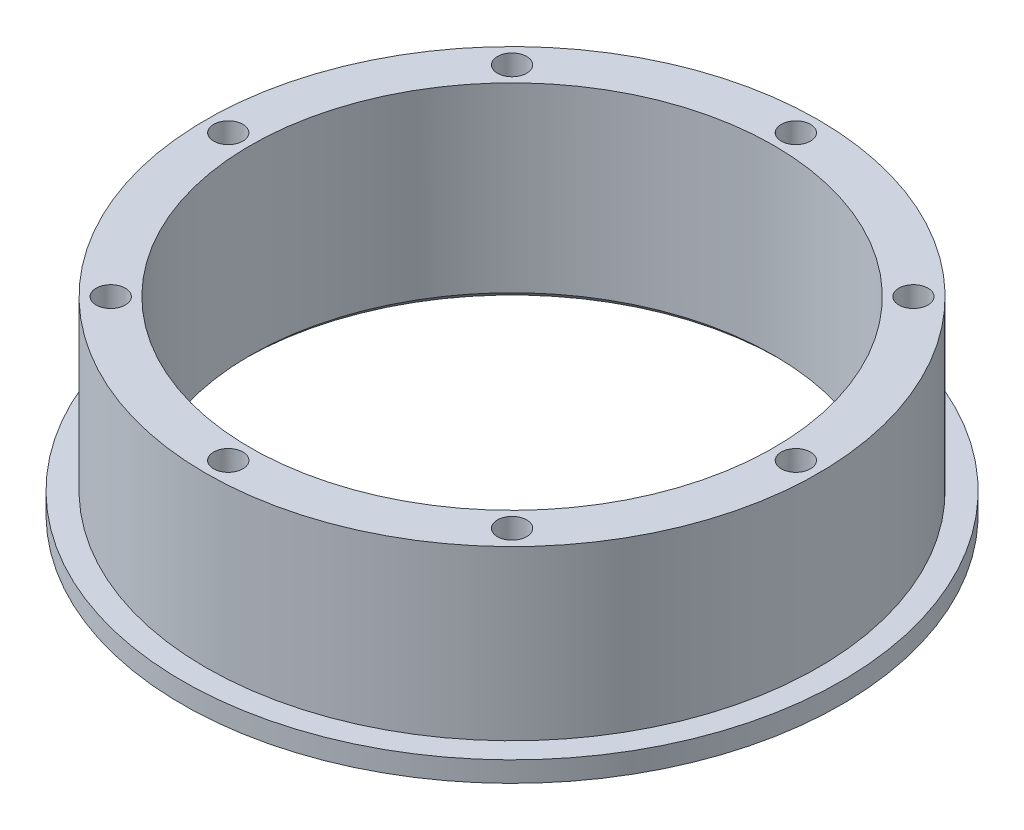
ISO-10303-21;
HEADER;
FILE_DESCRIPTION(('STEP AP214'),'2;1');
FILE_NAME('part.step','',(''),(''),'','','');
FILE_SCHEMA(('AUTOMOTIVE_DESIGN { 1 0 10303 214 1 1 1 1 }'));
ENDSEC;
DATA;
#1=APPLICATION_CONTEXT('core data for automotive mechanical design processes');
#2=APPLICATION_PROTOCOL_DEFINITION('international standard','automotive_design',2000,#1);
#3=PRODUCT_CONTEXT('',#1,'mechanical');
#4=PRODUCT('Part','Part','',(#3));
#5=PRODUCT_RELATED_PRODUCT_CATEGORY('part','',(#4));
#6=PRODUCT_DEFINITION_FORMATION('','',#4);
#7=PRODUCT_DEFINITION_CONTEXT('part definition',#1,'design');
#8=PRODUCT_DEFINITION('design','',#6,#7);
#9=PRODUCT_DEFINITION_SHAPE('','',#8);
#10=(LENGTH_UNIT() NAMED_UNIT(*) SI_UNIT(.MILLI.,.METRE.));
#11=(NAMED_UNIT(*) PLANE_ANGLE_UNIT() SI_UNIT($,.RADIAN.));
#12=(NAMED_UNIT(*) SI_UNIT($,.STERADIAN.) SOLID_ANGLE_UNIT());
#13=UNCERTAINTY_MEASURE_WITH_UNIT(LENGTH_MEASURE(1.E-05),#10,'distance_accuracy_value','');
#14=(GEOMETRIC_REPRESENTATION_CONTEXT(3) GLOBAL_UNCERTAINTY_ASSIGNED_CONTEXT((#13)) GLOBAL_UNIT_ASSIGNED_CONTEXT((#10,
#11,#12)) REPRESENTATION_CONTEXT('',''));
#15=CARTESIAN_POINT('',(0.,0.,0.));
#16=DIRECTION('',(0.,0.,1.));
#17=DIRECTION('',(1.,0.,0.));
#18=AXIS2_PLACEMENT_3D('',#15,#16,#17);
#19=CARTESIAN_POINT('',(0.,-102.238891196625,0.));
#20=DIRECTION('',(0.,-1.,0.));
#21=DIRECTION('',(0.,0.,-1.));
#22=AXIS2_PLACEMENT_3D('',#19,#20,#21);
#23=CYLINDRICAL_SURFACE('',#22,48.5);
#24=CARTESIAN_POINT('',(0.,-86.75,0.));
#25=DIRECTION('',(0.,-1.,0.));
#26=DIRECTION('',(0.,0.,-1.));
#27=AXIS2_PLACEMENT_3D('',#24,#25,#26);
#28=CIRCLE('',#27,48.5);
#29=CARTESIAN_POINT('',(0.,-86.75,-48.5));
#30=VERTEX_POINT('',#29);
#31=EDGE_CURVE('E47',#30,#30,#28,.T.);
#32=ORIENTED_EDGE('',*,*,#31,.F.);
#33=EDGE_LOOP('',(#32));
#34=FACE_BOUND('',#33,.T.);
#35=CARTESIAN_POINT('',(0.,-83.75,0.));
#36=DIRECTION('',(0.,-1.,0.));
#37=DIRECTION('',(0.,0.,-1.));
#38=AXIS2_PLACEMENT_3D('',#35,#36,#37);
#39=CIRCLE('',#38,48.5);
#40=CARTESIAN_POINT('',(0.,-83.75,-48.5));
#41=VERTEX_POINT('',#40);
#42=EDGE_CURVE('E52',#41,#41,#39,.T.);
#43=ORIENTED_EDGE('',*,*,#42,.T.);
#44=EDGE_LOOP('',(#43));
#45=FACE_BOUND('',#44,.T.);
#46=ADVANCED_FACE('F34',(#34,#45),#23,.T.);
#47=CARTESIAN_POINT('',(-48.5,-86.75,0.));
#48=DIRECTION('',(0.,1.,0.));
#49=DIRECTION('',(0.,0.,1.));
#50=AXIS2_PLACEMENT_3D('',#47,#48,#49);
#51=PLANE('',#50);
#52=CARTESIAN_POINT('',(0.,-86.75,0.));
#53=DIRECTION('',(0.,1.,0.));
#54=DIRECTION('',(0.,0.,1.));
#55=AXIS2_PLACEMENT_3D('',#52,#53,#54);
#56=CIRCLE('',#55,39.5272340808313);
#57=CARTESIAN_POINT('',(0.,-86.75,39.5272340808313));
#58=VERTEX_POINT('',#57);
#59=EDGE_CURVE('E11',#58,#58,#56,.T.);
#60=ORIENTED_EDGE('',*,*,#59,.T.);
#61=EDGE_LOOP('',(#60));
#62=FACE_BOUND('',#61,.T.);
#63=ORIENTED_EDGE('',*,*,#31,.T.);
#64=EDGE_LOOP('',(#63));
#65=FACE_BOUND('',#64,.T.);
#66=ADVANCED_FACE('F71',(#62,#65),#51,.F.);
#67=CARTESIAN_POINT('',(0.,-102.238891196625,0.));
#68=DIRECTION('',(0.,-1.,0.));
#69=DIRECTION('',(0.,0.,-1.));
#70=AXIS2_PLACEMENT_3D('',#67,#68,#69);
#71=CYLINDRICAL_SURFACE('',#70,38.5272340808313);
#72=CARTESIAN_POINT('',(0.,-85.75,0.));
#73=DIRECTION('',(0.,1.,0.));
#74=DIRECTION('',(0.,0.,1.));
#75=AXIS2_PLACEMENT_3D('',#72,#73,#74);
#76=CIRCLE('',#75,38.5272340808313);
#77=CARTESIAN_POINT('',(0.,-85.75,38.5272340808313));
#78=VERTEX_POINT('',#77);
#79=EDGE_CURVE('E42',#78,#78,#76,.F.);
#80=ORIENTED_EDGE('',*,*,#79,.T.);
#81=EDGE_LOOP('',(#80));
#82=FACE_BOUND('',#81,.T.);
#83=CARTESIAN_POINT('',(0.,-58.9999999999998,0.));
#84=DIRECTION('',(0.,-1.,0.));
#85=DIRECTION('',(0.,0.,-1.));
#86=AXIS2_PLACEMENT_3D('',#83,#84,#85);
#87=CIRCLE('',#86,38.5272340808313);
#88=CARTESIAN_POINT('',(0.,-58.9999999999998,-38.5272340808313));
#89=VERTEX_POINT('',#88);
#90=EDGE_CURVE('E56',#89,#89,#87,.T.);
#91=ORIENTED_EDGE('',*,*,#90,.F.);
#92=EDGE_LOOP('',(#91));
#93=FACE_BOUND('',#92,.T.);
#94=ADVANCED_FACE('F78',(#82,#93),#71,.F.);
#95=CARTESIAN_POINT('',(-45.,-59.,0.));
#96=DIRECTION('',(0.,-1.,0.));
#97=DIRECTION('',(0.,0.,-1.));
#98=AXIS2_PLACEMENT_3D('',#95,#96,#97);
#99=PLANE('',#98);
#100=CARTESIAN_POINT('',(-41.7636170404156,-59.,0.));
#101=DIRECTION('',(0.,1.,0.));
#102=DIRECTION('',(1.,0.,0.));
#103=AXIS2_PLACEMENT_3D('',#100,#101,#102);
#104=CIRCLE('',#103,2.15);
#105=CARTESIAN_POINT('',(-39.6136170404156,-59.,0.));
#106=VERTEX_POINT('',#105);
#107=EDGE_CURVE('E194',#106,#106,#104,.T.);
#108=ORIENTED_EDGE('',*,*,#107,.F.);
#109=EDGE_LOOP('',(#108));
#110=FACE_BOUND('',#109,.T.);
#111=CARTESIAN_POINT('',(-29.5313368161559,-59.,29.531336816156));
#112=DIRECTION('',(0.,1.,0.));
#113=DIRECTION('',(0.707106781186544,0.,-0.707106781186551));
#114=AXIS2_PLACEMENT_3D('',#111,#112,#113);
#115=CIRCLE('',#114,2.15);
#116=CARTESIAN_POINT('',(-28.0110572366049,-59.,28.0110572366049));
#117=VERTEX_POINT('',#116);
#118=EDGE_CURVE('E202',#117,#117,#115,.T.);
#119=ORIENTED_EDGE('',*,*,#118,.F.);
#120=EDGE_LOOP('',(#119));
#121=FACE_BOUND('',#120,.T.);
#122=CARTESIAN_POINT('',(-1.79804786889257E-13,-59.,41.7636170404156));
#123=DIRECTION('',(0.,1.,0.));
#124=DIRECTION('',(0.,0.,-1.));
#125=AXIS2_PLACEMENT_3D('',#122,#123,#124);
#126=CIRCLE('',#125,2.15);
#127=CARTESIAN_POINT('',(-1.79804786889257E-13,-59.,39.6136170404156));
#128=VERTEX_POINT('',#127);
#129=EDGE_CURVE('E208',#128,#128,#126,.T.);
#130=ORIENTED_EDGE('',*,*,#129,.F.);
#131=EDGE_LOOP('',(#130));
#132=FACE_BOUND('',#131,.T.);
#133=CARTESIAN_POINT('',(29.5313368161561,-59.,29.5313368161558));
#134=DIRECTION('',(0.,1.,0.));
#135=DIRECTION('',(-0.707106781186554,0.,-0.707106781186541));
#136=AXIS2_PLACEMENT_3D('',#133,#134,#135);
#137=CIRCLE('',#136,2.15);
#138=CARTESIAN_POINT('',(28.011057236605,-59.,28.0110572366048));
#139=VERTEX_POINT('',#138);
#140=EDGE_CURVE('E179',#139,#139,#137,.T.);
#141=ORIENTED_EDGE('',*,*,#140,.F.);
#142=EDGE_LOOP('',(#141));
#143=FACE_BOUND('',#142,.T.);
#144=CARTESIAN_POINT('',(41.7636170404156,-59.,-2.5764588172835E-13));
#145=DIRECTION('',(0.,1.,0.));
#146=DIRECTION('',(-1.,0.,0.));
#147=AXIS2_PLACEMENT_3D('',#144,#145,#146);
#148=CIRCLE('',#147,2.15);
#149=CARTESIAN_POINT('',(39.6136170404156,-59.,-2.35125827092811E-13));
#150=VERTEX_POINT('',#149);
#151=EDGE_CURVE('E180',#150,#150,#148,.T.);
#152=ORIENTED_EDGE('',*,*,#151,.F.);
#153=EDGE_LOOP('',(#152));
#154=FACE_BOUND('',#153,.T.);
#155=CARTESIAN_POINT('',(29.5313368161557,-59.,-29.5313368161562));
#156=DIRECTION('',(0.,1.,0.));
#157=DIRECTION('',(-0.707106781186539,0.,0.707106781186556));
#158=AXIS2_PLACEMENT_3D('',#155,#156,#157);
#159=CIRCLE('',#158,2.15);
#160=CARTESIAN_POINT('',(28.0110572366047,-59.,-28.0110572366051));
#161=VERTEX_POINT('',#160);
#162=EDGE_CURVE('E189',#161,#161,#159,.T.);
#163=ORIENTED_EDGE('',*,*,#162,.F.);
#164=EDGE_LOOP('',(#163));
#165=FACE_BOUND('',#164,.T.);
#166=CARTESIAN_POINT('',(-29.5313368161559,-59.,-29.531336816156));
#167=DIRECTION('',(0.,1.,0.));
#168=DIRECTION('',(0.707106781186549,0.,0.707106781186546));
#169=AXIS2_PLACEMENT_3D('',#166,#167,#168);
#170=CIRCLE('',#169,2.15);
#171=CARTESIAN_POINT('',(-28.0110572366048,-59.,-28.011057236605));
#172=VERTEX_POINT('',#171);
#173=EDGE_CURVE('E201',#172,#172,#170,.T.);
#174=ORIENTED_EDGE('',*,*,#173,.F.);
#175=EDGE_LOOP('',(#174));
#176=FACE_BOUND('',#175,.T.);
#177=CARTESIAN_POINT('',(1.79804786889257E-13,-59.,-41.7636170404156));
#178=DIRECTION('',(0.,1.,0.));
#179=DIRECTION('',(0.,0.,1.));
#180=AXIS2_PLACEMENT_3D('',#177,#178,#179);
#181=CIRCLE('',#180,2.15);
#182=CARTESIAN_POINT('',(1.79804786889257E-13,-59.,-39.6136170404156));
#183=VERTEX_POINT('',#182);
#184=EDGE_CURVE('E63',#183,#183,#181,.T.);
#185=ORIENTED_EDGE('',*,*,#184,.F.);
#186=EDGE_LOOP('',(#185));
#187=FACE_BOUND('',#186,.T.);
#188=CARTESIAN_POINT('',(0.,-59.,0.));
#189=DIRECTION('',(0.,-1.,0.));
#190=DIRECTION('',(0.,0.,-1.));
#191=AXIS2_PLACEMENT_3D('',#188,#189,#190);
#192=CIRCLE('',#191,45.0625);
#193=CARTESIAN_POINT('',(0.,-59.,-45.0625));
#194=VERTEX_POINT('',#193);
#195=EDGE_CURVE('E38',#194,#194,#192,.T.);
#196=ORIENTED_EDGE('',*,*,#195,.F.);
#197=EDGE_LOOP('',(#196));
#198=FACE_BOUND('',#197,.T.);
#199=ORIENTED_EDGE('',*,*,#90,.T.);
#200=EDGE_LOOP('',(#199));
#201=FACE_BOUND('',#200,.T.);
#202=ADVANCED_FACE('F99',(#110,#121,#132,#143,#154,#165,#176,#187,#198,#201),#99,.F.);
#203=CARTESIAN_POINT('',(0.,-102.238891196625,0.));
#204=DIRECTION('',(0.,-1.,0.));
#205=DIRECTION('',(0.,0.,-1.));
#206=AXIS2_PLACEMENT_3D('',#203,#204,#205);
#207=CYLINDRICAL_SURFACE('',#206,45.0625);
#208=CARTESIAN_POINT('',(0.,-83.75,0.));
#209=DIRECTION('',(0.,-1.,0.));
#210=DIRECTION('',(0.,0.,-1.));
#211=AXIS2_PLACEMENT_3D('',#208,#209,#210);
#212=CIRCLE('',#211,45.0625);
#213=CARTESIAN_POINT('',(0.,-83.75,-45.0625));
#214=VERTEX_POINT('',#213);
#215=EDGE_CURVE('E50',#214,#214,#212,.T.);
#216=ORIENTED_EDGE('',*,*,#215,.F.);
#217=EDGE_LOOP('',(#216));
#218=FACE_BOUND('',#217,.T.);
#219=ORIENTED_EDGE('',*,*,#195,.T.);
#220=EDGE_LOOP('',(#219));
#221=FACE_BOUND('',#220,.T.);
#222=ADVANCED_FACE('F36',(#218,#221),#207,.T.);
#223=CARTESIAN_POINT('',(-48.5,-83.75,0.));
#224=DIRECTION('',(0.,-1.,0.));
#225=DIRECTION('',(0.,0.,-1.));
#226=AXIS2_PLACEMENT_3D('',#223,#224,#225);
#227=PLANE('',#226);
#228=ORIENTED_EDGE('',*,*,#42,.F.);
#229=EDGE_LOOP('',(#228));
#230=FACE_BOUND('',#229,.T.);
#231=ORIENTED_EDGE('',*,*,#215,.T.);
#232=EDGE_LOOP('',(#231));
#233=FACE_BOUND('',#232,.T.);
#234=ADVANCED_FACE('F108',(#230,#233),#227,.F.);
#235=CARTESIAN_POINT('',(1.79804786889257E-13,-67.,-41.7636170404156));
#236=DIRECTION('',(0.,1.,0.));
#237=DIRECTION('',(0.,0.,1.));
#238=AXIS2_PLACEMENT_3D('',#235,#236,#237);
#239=CYLINDRICAL_SURFACE('',#238,2.15);
#240=CARTESIAN_POINT('',(1.79804786889257E-13,-67.,-41.7636170404156));
#241=DIRECTION('',(0.,1.,0.));
#242=DIRECTION('',(0.,0.,1.));
#243=AXIS2_PLACEMENT_3D('',#240,#241,#242);
#244=CIRCLE('',#243,2.15);
#245=CARTESIAN_POINT('',(1.79804786889257E-13,-67.,-39.6136170404156));
#246=VERTEX_POINT('',#245);
#247=EDGE_CURVE('E58',#246,#246,#244,.T.);
#248=ORIENTED_EDGE('',*,*,#247,.F.);
#249=EDGE_LOOP('',(#248));
#250=FACE_BOUND('',#249,.T.);
#251=ORIENTED_EDGE('',*,*,#184,.T.);
#252=EDGE_LOOP('',(#251));
#253=FACE_BOUND('',#252,.T.);
#254=ADVANCED_FACE('F115',(#250,#253),#239,.F.);
#255=CARTESIAN_POINT('',(1.79804786889257E-13,-67.,-41.7636170404156));
#256=DIRECTION('',(0.,1.,0.));
#257=DIRECTION('',(0.,0.,1.));
#258=AXIS2_PLACEMENT_3D('',#255,#256,#257);
#259=PLANE('',#258);
#260=ORIENTED_EDGE('',*,*,#247,.T.);
#261=EDGE_LOOP('',(#260));
#262=FACE_BOUND('',#261,.T.);
#263=ADVANCED_FACE('F119',(#262),#259,.T.);
#264=CARTESIAN_POINT('',(-29.5313368161559,-67.,-29.531336816156));
#265=DIRECTION('',(0.,1.,0.));
#266=DIRECTION('',(0.707106781186549,0.,0.707106781186546));
#267=AXIS2_PLACEMENT_3D('',#264,#265,#266);
#268=CYLINDRICAL_SURFACE('',#267,2.15);
#269=CARTESIAN_POINT('',(-29.5313368161559,-67.,-29.531336816156));
#270=DIRECTION('',(0.,1.,0.));
#271=DIRECTION('',(0.707106781186549,0.,0.707106781186546));
#272=AXIS2_PLACEMENT_3D('',#269,#270,#271);
#273=CIRCLE('',#272,2.15);
#274=CARTESIAN_POINT('',(-28.0110572366048,-67.,-28.011057236605));
#275=VERTEX_POINT('',#274);
#276=EDGE_CURVE('E217',#275,#275,#273,.T.);
#277=ORIENTED_EDGE('',*,*,#276,.F.);
#278=EDGE_LOOP('',(#277));
#279=FACE_BOUND('',#278,.T.);
#280=ORIENTED_EDGE('',*,*,#173,.T.);
#281=EDGE_LOOP('',(#280));
#282=FACE_BOUND('',#281,.T.);
#283=ADVANCED_FACE('F123',(#279,#282),#268,.F.);
#284=CARTESIAN_POINT('',(-29.5313368161559,-67.,-29.531336816156));
#285=DIRECTION('',(0.,1.,0.));
#286=DIRECTION('',(0.707106781186549,0.,0.707106781186546));
#287=AXIS2_PLACEMENT_3D('',#284,#285,#286);
#288=PLANE('',#287);
#289=ORIENTED_EDGE('',*,*,#276,.T.);
#290=EDGE_LOOP('',(#289));
#291=FACE_BOUND('',#290,.T.);
#292=ADVANCED_FACE('F127',(#291),#288,.T.);
#293=CARTESIAN_POINT('',(29.5313368161557,-67.,-29.5313368161562));
#294=DIRECTION('',(0.,1.,0.));
#295=DIRECTION('',(-0.707106781186539,0.,0.707106781186556));
#296=AXIS2_PLACEMENT_3D('',#293,#294,#295);
#297=CYLINDRICAL_SURFACE('',#296,2.15);
#298=CARTESIAN_POINT('',(29.5313368161557,-67.,-29.5313368161562));
#299=DIRECTION('',(0.,1.,0.));
#300=DIRECTION('',(-0.707106781186539,0.,0.707106781186556));
#301=AXIS2_PLACEMENT_3D('',#298,#299,#300);
#302=CIRCLE('',#301,2.15);
#303=CARTESIAN_POINT('',(28.0110572366047,-67.,-28.0110572366051));
#304=VERTEX_POINT('',#303);
#305=EDGE_CURVE('E186',#304,#304,#302,.T.);
#306=ORIENTED_EDGE('',*,*,#305,.F.);
#307=EDGE_LOOP('',(#306));
#308=FACE_BOUND('',#307,.T.);
#309=ORIENTED_EDGE('',*,*,#162,.T.);
#310=EDGE_LOOP('',(#309));
#311=FACE_BOUND('',#310,.T.);
#312=ADVANCED_FACE('F131',(#308,#311),#297,.F.);
#313=CARTESIAN_POINT('',(29.5313368161557,-67.,-29.5313368161562));
#314=DIRECTION('',(0.,1.,0.));
#315=DIRECTION('',(-0.707106781186539,0.,0.707106781186556));
#316=AXIS2_PLACEMENT_3D('',#313,#314,#315);
#317=PLANE('',#316);
#318=ORIENTED_EDGE('',*,*,#305,.T.);
#319=EDGE_LOOP('',(#318));
#320=FACE_BOUND('',#319,.T.);
#321=ADVANCED_FACE('F163',(#320),#317,.T.);
#322=CARTESIAN_POINT('',(41.7636170404156,-67.,-2.5764588172835E-13));
#323=DIRECTION('',(0.,1.,0.));
#324=DIRECTION('',(-1.,0.,0.));
#325=AXIS2_PLACEMENT_3D('',#322,#323,#324);
#326=CYLINDRICAL_SURFACE('',#325,2.15);
#327=CARTESIAN_POINT('',(41.7636170404156,-67.,-2.5764588172835E-13));
#328=DIRECTION('',(0.,1.,0.));
#329=DIRECTION('',(-1.,0.,0.));
#330=AXIS2_PLACEMENT_3D('',#327,#328,#329);
#331=CIRCLE('',#330,2.15);
#332=CARTESIAN_POINT('',(39.6136170404156,-67.,-2.35125827092811E-13));
#333=VERTEX_POINT('',#332);
#334=EDGE_CURVE('E178',#333,#333,#331,.T.);
#335=ORIENTED_EDGE('',*,*,#334,.F.);
#336=EDGE_LOOP('',(#335));
#337=FACE_BOUND('',#336,.T.);
#338=ORIENTED_EDGE('',*,*,#151,.T.);
#339=EDGE_LOOP('',(#338));
#340=FACE_BOUND('',#339,.T.);
#341=ADVANCED_FACE('F167',(#337,#340),#326,.F.);
#342=CARTESIAN_POINT('',(41.7636170404156,-67.,-2.5764588172835E-13));
#343=DIRECTION('',(0.,1.,0.));
#344=DIRECTION('',(-1.,0.,0.));
#345=AXIS2_PLACEMENT_3D('',#342,#343,#344);
#346=PLANE('',#345);
#347=ORIENTED_EDGE('',*,*,#334,.T.);
#348=EDGE_LOOP('',(#347));
#349=FACE_BOUND('',#348,.T.);
#350=ADVANCED_FACE('F137',(#349),#346,.T.);
#351=CARTESIAN_POINT('',(29.5313368161561,-67.,29.5313368161558));
#352=DIRECTION('',(0.,1.,0.));
#353=DIRECTION('',(-0.707106781186554,0.,-0.707106781186541));
#354=AXIS2_PLACEMENT_3D('',#351,#352,#353);
#355=CYLINDRICAL_SURFACE('',#354,2.15);
#356=CARTESIAN_POINT('',(29.5313368161561,-67.,29.5313368161558));
#357=DIRECTION('',(0.,1.,0.));
#358=DIRECTION('',(-0.707106781186554,0.,-0.707106781186541));
#359=AXIS2_PLACEMENT_3D('',#356,#357,#358);
#360=CIRCLE('',#359,2.15);
#361=CARTESIAN_POINT('',(28.011057236605,-67.,28.0110572366048));
#362=VERTEX_POINT('',#361);
#363=EDGE_CURVE('E183',#362,#362,#360,.T.);
#364=ORIENTED_EDGE('',*,*,#363,.F.);
#365=EDGE_LOOP('',(#364));
#366=FACE_BOUND('',#365,.T.);
#367=ORIENTED_EDGE('',*,*,#140,.T.);
#368=EDGE_LOOP('',(#367));
#369=FACE_BOUND('',#368,.T.);
#370=ADVANCED_FACE('F133',(#366,#369),#355,.F.);
#371=CARTESIAN_POINT('',(29.5313368161561,-67.,29.5313368161558));
#372=DIRECTION('',(0.,1.,0.));
#373=DIRECTION('',(-0.707106781186554,0.,-0.707106781186541));
#374=AXIS2_PLACEMENT_3D('',#371,#372,#373);
#375=PLANE('',#374);
#376=ORIENTED_EDGE('',*,*,#363,.T.);
#377=EDGE_LOOP('',(#376));
#378=FACE_BOUND('',#377,.T.);
#379=ADVANCED_FACE('F136',(#378),#375,.T.);
#380=CARTESIAN_POINT('',(-1.79804786889257E-13,-67.,41.7636170404156));
#381=DIRECTION('',(0.,1.,0.));
#382=DIRECTION('',(0.,0.,-1.));
#383=AXIS2_PLACEMENT_3D('',#380,#381,#382);
#384=CYLINDRICAL_SURFACE('',#383,2.15);
#385=CARTESIAN_POINT('',(-1.79804786889257E-13,-67.,41.7636170404156));
#386=DIRECTION('',(0.,1.,0.));
#387=DIRECTION('',(0.,0.,-1.));
#388=AXIS2_PLACEMENT_3D('',#385,#386,#387);
#389=CIRCLE('',#388,2.15);
#390=CARTESIAN_POINT('',(-1.79804786889257E-13,-67.,39.6136170404156));
#391=VERTEX_POINT('',#390);
#392=EDGE_CURVE('E205',#391,#391,#389,.T.);
#393=ORIENTED_EDGE('',*,*,#392,.F.);
#394=EDGE_LOOP('',(#393));
#395=FACE_BOUND('',#394,.T.);
#396=ORIENTED_EDGE('',*,*,#129,.T.);
#397=EDGE_LOOP('',(#396));
#398=FACE_BOUND('',#397,.T.);
#399=ADVANCED_FACE('F141',(#395,#398),#384,.F.);
#400=CARTESIAN_POINT('',(-1.79804786889257E-13,-67.,41.7636170404156));
#401=DIRECTION('',(0.,1.,0.));
#402=DIRECTION('',(0.,0.,-1.));
#403=AXIS2_PLACEMENT_3D('',#400,#401,#402);
#404=PLANE('',#403);
#405=ORIENTED_EDGE('',*,*,#392,.T.);
#406=EDGE_LOOP('',(#405));
#407=FACE_BOUND('',#406,.T.);
#408=ADVANCED_FACE('F145',(#407),#404,.T.);
#409=CARTESIAN_POINT('',(-29.5313368161559,-67.,29.531336816156));
#410=DIRECTION('',(0.,1.,0.));
#411=DIRECTION('',(0.707106781186544,0.,-0.707106781186551));
#412=AXIS2_PLACEMENT_3D('',#409,#410,#411);
#413=CYLINDRICAL_SURFACE('',#412,2.15);
#414=CARTESIAN_POINT('',(-29.5313368161559,-67.,29.531336816156));
#415=DIRECTION('',(0.,1.,0.));
#416=DIRECTION('',(0.707106781186544,0.,-0.707106781186551));
#417=AXIS2_PLACEMENT_3D('',#414,#415,#416);
#418=CIRCLE('',#417,2.15);
#419=CARTESIAN_POINT('',(-28.0110572366049,-67.,28.0110572366049));
#420=VERTEX_POINT('',#419);
#421=EDGE_CURVE('E198',#420,#420,#418,.T.);
#422=ORIENTED_EDGE('',*,*,#421,.F.);
#423=EDGE_LOOP('',(#422));
#424=FACE_BOUND('',#423,.T.);
#425=ORIENTED_EDGE('',*,*,#118,.T.);
#426=EDGE_LOOP('',(#425));
#427=FACE_BOUND('',#426,.T.);
#428=ADVANCED_FACE('F149',(#424,#427),#413,.F.);
#429=CARTESIAN_POINT('',(-29.5313368161559,-67.,29.531336816156));
#430=DIRECTION('',(0.,1.,0.));
#431=DIRECTION('',(0.707106781186544,0.,-0.707106781186551));
#432=AXIS2_PLACEMENT_3D('',#429,#430,#431);
#433=PLANE('',#432);
#434=ORIENTED_EDGE('',*,*,#421,.T.);
#435=EDGE_LOOP('',(#434));
#436=FACE_BOUND('',#435,.T.);
#437=ADVANCED_FACE('F153',(#436),#433,.T.);
#438=CARTESIAN_POINT('',(-41.7636170404156,-67.,0.));
#439=DIRECTION('',(0.,1.,0.));
#440=DIRECTION('',(1.,0.,0.));
#441=AXIS2_PLACEMENT_3D('',#438,#439,#440);
#442=CYLINDRICAL_SURFACE('',#441,2.15);
#443=CARTESIAN_POINT('',(-41.7636170404156,-67.,0.));
#444=DIRECTION('',(0.,1.,0.));
#445=DIRECTION('',(1.,0.,0.));
#446=AXIS2_PLACEMENT_3D('',#443,#444,#445);
#447=CIRCLE('',#446,2.15);
#448=CARTESIAN_POINT('',(-39.6136170404156,-67.,0.));
#449=VERTEX_POINT('',#448);
#450=EDGE_CURVE('E197',#449,#449,#447,.T.);
#451=ORIENTED_EDGE('',*,*,#450,.F.);
#452=EDGE_LOOP('',(#451));
#453=FACE_BOUND('',#452,.T.);
#454=ORIENTED_EDGE('',*,*,#107,.T.);
#455=EDGE_LOOP('',(#454));
#456=FACE_BOUND('',#455,.T.);
#457=ADVANCED_FACE('F91',(#453,#456),#442,.F.);
#458=CARTESIAN_POINT('',(-41.7636170404156,-67.,0.));
#459=DIRECTION('',(0.,1.,0.));
#460=DIRECTION('',(1.,0.,0.));
#461=AXIS2_PLACEMENT_3D('',#458,#459,#460);
#462=PLANE('',#461);
#463=ORIENTED_EDGE('',*,*,#450,.T.);
#464=EDGE_LOOP('',(#463));
#465=FACE_BOUND('',#464,.T.);
#466=ADVANCED_FACE('F86',(#465),#462,.T.);
#467=CARTESIAN_POINT('',(0.,-85.75,0.));
#468=DIRECTION('',(0.,-1.,0.));
#469=DIRECTION('',(0.,0.,-1.));
#470=AXIS2_PLACEMENT_3D('',#467,#468,#469);
#471=CONICAL_SURFACE('',#470,38.5272340808313,0.785398163397448);
#472=ORIENTED_EDGE('',*,*,#59,.F.);
#473=EDGE_LOOP('',(#472));
#474=FACE_BOUND('',#473,.T.);
#475=ORIENTED_EDGE('',*,*,#79,.F.);
#476=EDGE_LOOP('',(#475));
#477=FACE_BOUND('',#476,.T.);
#478=ADVANCED_FACE('F82',(#474,#477),#471,.F.);
#479=CLOSED_SHELL('',(#46,#66,#94,#202,#222,#234,#254,#263,#283,#292,#312,#321,#341,#350,#370,
#379,#399,#408,#428,#437,#457,#466,#478));
#480=MANIFOLD_SOLID_BREP('B2',#479);
#481=ADVANCED_BREP_SHAPE_REPRESENTATION('',(#18,#480),#14);
#482=SHAPE_DEFINITION_REPRESENTATION(#9,#481);
ENDSEC;
END-ISO-10303-21;
